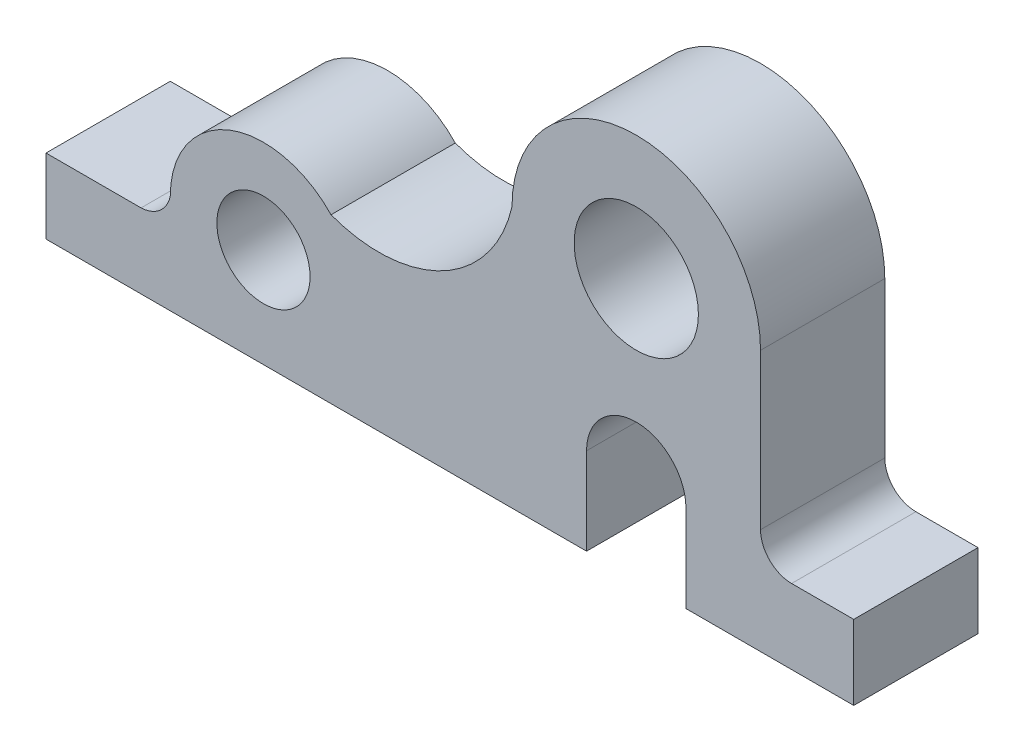
ISO-10303-21;
HEADER;
FILE_DESCRIPTION(('STEP AP214'),'2;1');
FILE_NAME('part.step','',(''),(''),'','','');
FILE_SCHEMA(('AUTOMOTIVE_DESIGN { 1 0 10303 214 1 1 1 1 }'));
ENDSEC;
DATA;
#1=APPLICATION_CONTEXT('core data for automotive mechanical design processes');
#2=APPLICATION_PROTOCOL_DEFINITION('international standard','automotive_design',2000,#1);
#3=PRODUCT_CONTEXT('',#1,'mechanical');
#4=PRODUCT('Part','Part','',(#3));
#5=PRODUCT_RELATED_PRODUCT_CATEGORY('part','',(#4));
#6=PRODUCT_DEFINITION_FORMATION('','',#4);
#7=PRODUCT_DEFINITION_CONTEXT('part definition',#1,'design');
#8=PRODUCT_DEFINITION('design','',#6,#7);
#9=PRODUCT_DEFINITION_SHAPE('','',#8);
#10=(LENGTH_UNIT() NAMED_UNIT(*) SI_UNIT(.MILLI.,.METRE.));
#11=(NAMED_UNIT(*) PLANE_ANGLE_UNIT() SI_UNIT($,.RADIAN.));
#12=(NAMED_UNIT(*) SI_UNIT($,.STERADIAN.) SOLID_ANGLE_UNIT());
#13=UNCERTAINTY_MEASURE_WITH_UNIT(LENGTH_MEASURE(1.E-05),#10,'distance_accuracy_value','');
#14=(GEOMETRIC_REPRESENTATION_CONTEXT(3) GLOBAL_UNCERTAINTY_ASSIGNED_CONTEXT((#13)) GLOBAL_UNIT_ASSIGNED_CONTEXT((#10,
#11,#12)) REPRESENTATION_CONTEXT('',''));
#15=CARTESIAN_POINT('',(0.,0.,0.));
#16=DIRECTION('',(0.,0.,1.));
#17=DIRECTION('',(1.,0.,0.));
#18=AXIS2_PLACEMENT_3D('',#15,#16,#17);
#19=CARTESIAN_POINT('',(15.1002070773212,16.9960066841476,10.));
#20=DIRECTION('',(0.,0.,1.));
#21=DIRECTION('',(1.,0.,0.));
#22=AXIS2_PLACEMENT_3D('',#19,#20,#21);
#23=PLANE('',#22);
#24=CARTESIAN_POINT('',(35.,16.,10.));
#25=DIRECTION('',(0.,0.,1.));
#26=DIRECTION('',(1.,0.,0.));
#27=AXIS2_PLACEMENT_3D('',#24,#25,#26);
#28=CIRCLE('',#27,7.5);
#29=CARTESIAN_POINT('',(42.5,16.,10.));
#30=VERTEX_POINT('',#29);
#31=EDGE_CURVE('E178',#30,#30,#28,.T.);
#32=ORIENTED_EDGE('',*,*,#31,.F.);
#33=EDGE_LOOP('',(#32));
#34=FACE_BOUND('',#33,.T.);
#35=DIRECTION('',(0.,-1.,0.));
#36=VECTOR('',#35,1.);
#37=CARTESIAN_POINT('',(0.,0.,10.));
#38=LINE('',#37,#36);
#39=CARTESIAN_POINT('',(0.,12.,10.));
#40=VERTEX_POINT('',#39);
#41=CARTESIAN_POINT('',(0.,0.,10.));
#42=VERTEX_POINT('',#41);
#43=EDGE_CURVE('E203',#40,#42,#38,.T.);
#44=ORIENTED_EDGE('',*,*,#43,.T.);
#45=DIRECTION('',(1.,0.,0.));
#46=VECTOR('',#45,1.);
#47=CARTESIAN_POINT('',(0.,0.,10.));
#48=LINE('',#47,#46);
#49=CARTESIAN_POINT('',(87.,0.,10.));
#50=VERTEX_POINT('',#49);
#51=EDGE_CURVE('E116',#42,#50,#48,.T.);
#52=ORIENTED_EDGE('',*,*,#51,.T.);
#53=DIRECTION('',(0.,1.,0.));
#54=VECTOR('',#53,1.);
#55=CARTESIAN_POINT('',(87.,0.,10.));
#56=LINE('',#55,#54);
#57=CARTESIAN_POINT('',(87.,14.,10.));
#58=VERTEX_POINT('',#57);
#59=EDGE_CURVE('E239',#50,#58,#56,.T.);
#60=ORIENTED_EDGE('',*,*,#59,.T.);
#61=CARTESIAN_POINT('',(95.,14.,10.));
#62=DIRECTION('',(0.,0.,-1.));
#63=DIRECTION('',(-1.,0.,0.));
#64=AXIS2_PLACEMENT_3D('',#61,#62,#63);
#65=CIRCLE('',#64,8.);
#66=CARTESIAN_POINT('',(103.,14.,10.));
#67=VERTEX_POINT('',#66);
#68=EDGE_CURVE('E258',#58,#67,#65,.T.);
#69=ORIENTED_EDGE('',*,*,#68,.T.);
#70=DIRECTION('',(0.,-1.,0.));
#71=VECTOR('',#70,1.);
#72=CARTESIAN_POINT('',(103.,14.,10.));
#73=LINE('',#72,#71);
#74=CARTESIAN_POINT('',(103.,0.,10.));
#75=VERTEX_POINT('',#74);
#76=EDGE_CURVE('E255',#67,#75,#73,.T.);
#77=ORIENTED_EDGE('',*,*,#76,.T.);
#78=DIRECTION('',(1.,0.,0.));
#79=VECTOR('',#78,1.);
#80=CARTESIAN_POINT('',(103.,0.,10.));
#81=LINE('',#80,#79);
#82=CARTESIAN_POINT('',(130.,0.,10.));
#83=VERTEX_POINT('',#82);
#84=EDGE_CURVE('E257',#75,#83,#81,.T.);
#85=ORIENTED_EDGE('',*,*,#84,.T.);
#86=DIRECTION('',(0.,1.,0.));
#87=VECTOR('',#86,1.);
#88=CARTESIAN_POINT('',(130.,0.,10.));
#89=LINE('',#88,#87);
#90=CARTESIAN_POINT('',(130.,12.,10.));
#91=VERTEX_POINT('',#90);
#92=EDGE_CURVE('E260',#83,#91,#89,.T.);
#93=ORIENTED_EDGE('',*,*,#92,.T.);
#94=DIRECTION('',(-1.,0.,0.));
#95=VECTOR('',#94,1.);
#96=CARTESIAN_POINT('',(120.,12.,10.));
#97=LINE('',#96,#95);
#98=CARTESIAN_POINT('',(120.,12.,10.));
#99=VERTEX_POINT('',#98);
#100=EDGE_CURVE('E266',#91,#99,#97,.T.);
#101=ORIENTED_EDGE('',*,*,#100,.T.);
#102=CARTESIAN_POINT('',(120.,17.,10.));
#103=DIRECTION('',(0.,0.,-1.));
#104=DIRECTION('',(1.,0.,0.));
#105=AXIS2_PLACEMENT_3D('',#102,#103,#104);
#106=CIRCLE('',#105,5.);
#107=CARTESIAN_POINT('',(115.,17.,10.));
#108=VERTEX_POINT('',#107);
#109=EDGE_CURVE('E268',#99,#108,#106,.T.);
#110=ORIENTED_EDGE('',*,*,#109,.T.);
#111=DIRECTION('',(0.,1.,0.));
#112=VECTOR('',#111,1.);
#113=CARTESIAN_POINT('',(115.,42.,10.));
#114=LINE('',#113,#112);
#115=CARTESIAN_POINT('',(115.,42.,10.));
#116=VERTEX_POINT('',#115);
#117=EDGE_CURVE('E270',#108,#116,#114,.T.);
#118=ORIENTED_EDGE('',*,*,#117,.T.);
#119=CARTESIAN_POINT('',(95.,42.,10.));
#120=DIRECTION('',(0.,0.,1.));
#121=DIRECTION('',(1.,0.,0.));
#122=AXIS2_PLACEMENT_3D('',#119,#120,#121);
#123=CIRCLE('',#122,20.);
#124=CARTESIAN_POINT('',(75.,42.,10.));
#125=VERTEX_POINT('',#124);
#126=EDGE_CURVE('E272',#116,#125,#123,.T.);
#127=ORIENTED_EDGE('',*,*,#126,.T.);
#128=CARTESIAN_POINT('',(53.5628393291746,46.9445062820485,10.));
#129=DIRECTION('',(0.,0.,-1.));
#130=DIRECTION('',(1.,0.,0.));
#131=AXIS2_PLACEMENT_3D('',#128,#129,#130);
#132=CIRCLE('',#131,22.);
#133=CARTESIAN_POINT('',(45.8746463214635,26.331605266515,10.));
#134=VERTEX_POINT('',#133);
#135=EDGE_CURVE('E156',#125,#134,#132,.T.);
#136=ORIENTED_EDGE('',*,*,#135,.T.);
#137=CARTESIAN_POINT('',(35.,16.,10.));
#138=DIRECTION('',(0.,0.,1.));
#139=DIRECTION('',(1.,0.,0.));
#140=AXIS2_PLACEMENT_3D('',#137,#138,#139);
#141=CIRCLE('',#140,15.);
#142=CARTESIAN_POINT('',(20.,16.,10.));
#143=VERTEX_POINT('',#142);
#144=EDGE_CURVE('E150',#134,#143,#141,.T.);
#145=ORIENTED_EDGE('',*,*,#144,.T.);
#146=CARTESIAN_POINT('',(15.1002070773212,16.9960066841476,10.));
#147=DIRECTION('',(0.,0.,-1.));
#148=DIRECTION('',(1.,0.,0.));
#149=AXIS2_PLACEMENT_3D('',#146,#147,#148);
#150=CIRCLE('',#149,5.);
#151=CARTESIAN_POINT('',(15.3,12.,10.));
#152=VERTEX_POINT('',#151);
#153=EDGE_CURVE('E154',#143,#152,#150,.T.);
#154=ORIENTED_EDGE('',*,*,#153,.T.);
#155=DIRECTION('',(-1.,0.,0.));
#156=VECTOR('',#155,1.);
#157=CARTESIAN_POINT('',(0.,12.,10.));
#158=LINE('',#157,#156);
#159=EDGE_CURVE('E52',#152,#40,#158,.T.);
#160=ORIENTED_EDGE('',*,*,#159,.T.);
#161=EDGE_LOOP('',(#44,#52,#60,#69,#77,#85,#93,#101,#110,#118,#127,#136,#145,#154,#160));
#162=FACE_BOUND('',#161,.T.);
#163=CARTESIAN_POINT('',(95.,42.,10.));
#164=DIRECTION('',(0.,0.,1.));
#165=DIRECTION('',(1.,0.,0.));
#166=AXIS2_PLACEMENT_3D('',#163,#164,#165);
#167=CIRCLE('',#166,9.99999999999999);
#168=CARTESIAN_POINT('',(105.,42.,10.));
#169=VERTEX_POINT('',#168);
#170=EDGE_CURVE('E314',#169,#169,#167,.T.);
#171=ORIENTED_EDGE('',*,*,#170,.F.);
#172=EDGE_LOOP('',(#171));
#173=FACE_BOUND('',#172,.T.);
#174=ADVANCED_FACE('F35',(#34,#162,#173),#23,.T.);
#175=CARTESIAN_POINT('',(15.1002070773212,16.9960066841476,-10.));
#176=DIRECTION('',(0.,0.,1.));
#177=DIRECTION('',(1.,0.,0.));
#178=AXIS2_PLACEMENT_3D('',#175,#176,#177);
#179=PLANE('',#178);
#180=DIRECTION('',(0.,-1.,0.));
#181=VECTOR('',#180,1.);
#182=CARTESIAN_POINT('',(0.,0.,-10.));
#183=LINE('',#182,#181);
#184=CARTESIAN_POINT('',(0.,12.,-10.));
#185=VERTEX_POINT('',#184);
#186=CARTESIAN_POINT('',(0.,0.,-10.));
#187=VERTEX_POINT('',#186);
#188=EDGE_CURVE('E174',#185,#187,#183,.T.);
#189=ORIENTED_EDGE('',*,*,#188,.F.);
#190=DIRECTION('',(-1.,0.,0.));
#191=VECTOR('',#190,1.);
#192=CARTESIAN_POINT('',(0.,12.,-10.));
#193=LINE('',#192,#191);
#194=CARTESIAN_POINT('',(15.3,12.,-10.));
#195=VERTEX_POINT('',#194);
#196=EDGE_CURVE('E108',#195,#185,#193,.T.);
#197=ORIENTED_EDGE('',*,*,#196,.F.);
#198=CARTESIAN_POINT('',(15.1002070773212,16.9960066841476,-10.));
#199=DIRECTION('',(0.,0.,-1.));
#200=DIRECTION('',(1.,0.,0.));
#201=AXIS2_PLACEMENT_3D('',#198,#199,#200);
#202=CIRCLE('',#201,5.);
#203=CARTESIAN_POINT('',(20.,16.,-10.));
#204=VERTEX_POINT('',#203);
#205=EDGE_CURVE('E102',#204,#195,#202,.T.);
#206=ORIENTED_EDGE('',*,*,#205,.F.);
#207=CARTESIAN_POINT('',(35.,16.,-10.));
#208=DIRECTION('',(0.,0.,1.));
#209=DIRECTION('',(1.,0.,0.));
#210=AXIS2_PLACEMENT_3D('',#207,#208,#209);
#211=CIRCLE('',#210,15.);
#212=CARTESIAN_POINT('',(45.8746463214635,26.331605266515,-10.));
#213=VERTEX_POINT('',#212);
#214=EDGE_CURVE('E164',#213,#204,#211,.T.);
#215=ORIENTED_EDGE('',*,*,#214,.F.);
#216=CARTESIAN_POINT('',(53.5628393291746,46.9445062820485,-10.));
#217=DIRECTION('',(0.,0.,-1.));
#218=DIRECTION('',(1.,0.,0.));
#219=AXIS2_PLACEMENT_3D('',#216,#217,#218);
#220=CIRCLE('',#219,22.);
#221=CARTESIAN_POINT('',(75.,42.,-10.));
#222=VERTEX_POINT('',#221);
#223=EDGE_CURVE('E198',#222,#213,#220,.T.);
#224=ORIENTED_EDGE('',*,*,#223,.F.);
#225=CARTESIAN_POINT('',(95.,42.,-10.));
#226=DIRECTION('',(0.,0.,1.));
#227=DIRECTION('',(1.,0.,0.));
#228=AXIS2_PLACEMENT_3D('',#225,#226,#227);
#229=CIRCLE('',#228,20.);
#230=CARTESIAN_POINT('',(115.,42.,-10.));
#231=VERTEX_POINT('',#230);
#232=EDGE_CURVE('E196',#231,#222,#229,.T.);
#233=ORIENTED_EDGE('',*,*,#232,.F.);
#234=DIRECTION('',(0.,1.,0.));
#235=VECTOR('',#234,1.);
#236=CARTESIAN_POINT('',(115.,42.,-10.));
#237=LINE('',#236,#235);
#238=CARTESIAN_POINT('',(115.,17.,-10.));
#239=VERTEX_POINT('',#238);
#240=EDGE_CURVE('E194',#239,#231,#237,.T.);
#241=ORIENTED_EDGE('',*,*,#240,.F.);
#242=CARTESIAN_POINT('',(120.,17.,-10.));
#243=DIRECTION('',(0.,0.,-1.));
#244=DIRECTION('',(1.,0.,0.));
#245=AXIS2_PLACEMENT_3D('',#242,#243,#244);
#246=CIRCLE('',#245,5.);
#247=CARTESIAN_POINT('',(120.,12.,-10.));
#248=VERTEX_POINT('',#247);
#249=EDGE_CURVE('E192',#248,#239,#246,.T.);
#250=ORIENTED_EDGE('',*,*,#249,.F.);
#251=DIRECTION('',(-1.,0.,0.));
#252=VECTOR('',#251,1.);
#253=CARTESIAN_POINT('',(120.,12.,-10.));
#254=LINE('',#253,#252);
#255=CARTESIAN_POINT('',(130.,12.,-10.));
#256=VERTEX_POINT('',#255);
#257=EDGE_CURVE('E190',#256,#248,#254,.T.);
#258=ORIENTED_EDGE('',*,*,#257,.F.);
#259=DIRECTION('',(0.,1.,0.));
#260=VECTOR('',#259,1.);
#261=CARTESIAN_POINT('',(130.,0.,-10.));
#262=LINE('',#261,#260);
#263=CARTESIAN_POINT('',(130.,0.,-10.));
#264=VERTEX_POINT('',#263);
#265=EDGE_CURVE('E188',#264,#256,#262,.T.);
#266=ORIENTED_EDGE('',*,*,#265,.F.);
#267=DIRECTION('',(1.,0.,0.));
#268=VECTOR('',#267,1.);
#269=CARTESIAN_POINT('',(103.,0.,-10.));
#270=LINE('',#269,#268);
#271=CARTESIAN_POINT('',(103.,0.,-10.));
#272=VERTEX_POINT('',#271);
#273=EDGE_CURVE('E186',#272,#264,#270,.T.);
#274=ORIENTED_EDGE('',*,*,#273,.F.);
#275=DIRECTION('',(0.,-1.,0.));
#276=VECTOR('',#275,1.);
#277=CARTESIAN_POINT('',(103.,14.,-10.));
#278=LINE('',#277,#276);
#279=CARTESIAN_POINT('',(103.,14.,-10.));
#280=VERTEX_POINT('',#279);
#281=EDGE_CURVE('E184',#280,#272,#278,.T.);
#282=ORIENTED_EDGE('',*,*,#281,.F.);
#283=CARTESIAN_POINT('',(95.,14.,-10.));
#284=DIRECTION('',(0.,0.,-1.));
#285=DIRECTION('',(-1.,0.,0.));
#286=AXIS2_PLACEMENT_3D('',#283,#284,#285);
#287=CIRCLE('',#286,8.);
#288=CARTESIAN_POINT('',(87.,14.,-10.));
#289=VERTEX_POINT('',#288);
#290=EDGE_CURVE('E182',#289,#280,#287,.T.);
#291=ORIENTED_EDGE('',*,*,#290,.F.);
#292=DIRECTION('',(0.,1.,0.));
#293=VECTOR('',#292,1.);
#294=CARTESIAN_POINT('',(87.,0.,-10.));
#295=LINE('',#294,#293);
#296=CARTESIAN_POINT('',(87.,0.,-10.));
#297=VERTEX_POINT('',#296);
#298=EDGE_CURVE('E180',#297,#289,#295,.T.);
#299=ORIENTED_EDGE('',*,*,#298,.F.);
#300=DIRECTION('',(1.,0.,0.));
#301=VECTOR('',#300,1.);
#302=CARTESIAN_POINT('',(0.,0.,-10.));
#303=LINE('',#302,#301);
#304=EDGE_CURVE('E177',#187,#297,#303,.T.);
#305=ORIENTED_EDGE('',*,*,#304,.F.);
#306=EDGE_LOOP('',(#189,#197,#206,#215,#224,#233,#241,#250,#258,#266,#274,#282,#291,#299,#305));
#307=FACE_BOUND('',#306,.T.);
#308=CARTESIAN_POINT('',(35.,16.,-10.));
#309=DIRECTION('',(0.,0.,1.));
#310=DIRECTION('',(1.,0.,0.));
#311=AXIS2_PLACEMENT_3D('',#308,#309,#310);
#312=CIRCLE('',#311,7.5);
#313=CARTESIAN_POINT('',(42.5,16.,-10.));
#314=VERTEX_POINT('',#313);
#315=EDGE_CURVE('E320',#314,#314,#312,.T.);
#316=ORIENTED_EDGE('',*,*,#315,.T.);
#317=EDGE_LOOP('',(#316));
#318=FACE_BOUND('',#317,.T.);
#319=CARTESIAN_POINT('',(95.,42.,-10.));
#320=DIRECTION('',(0.,0.,1.));
#321=DIRECTION('',(1.,0.,0.));
#322=AXIS2_PLACEMENT_3D('',#319,#320,#321);
#323=CIRCLE('',#322,9.99999999999999);
#324=CARTESIAN_POINT('',(105.,42.,-10.));
#325=VERTEX_POINT('',#324);
#326=EDGE_CURVE('E317',#325,#325,#323,.T.);
#327=ORIENTED_EDGE('',*,*,#326,.T.);
#328=EDGE_LOOP('',(#327));
#329=FACE_BOUND('',#328,.T.);
#330=ADVANCED_FACE('F243',(#307,#318,#329),#179,.F.);
#331=CARTESIAN_POINT('',(0.,0.,10.));
#332=DIRECTION('',(1.,0.,0.));
#333=DIRECTION('',(0.,0.,-1.));
#334=AXIS2_PLACEMENT_3D('',#331,#332,#333);
#335=PLANE('',#334);
#336=ORIENTED_EDGE('',*,*,#188,.T.);
#337=DIRECTION('',(0.,0.,-1.));
#338=VECTOR('',#337,1.);
#339=CARTESIAN_POINT('',(0.,0.,10.));
#340=LINE('',#339,#338);
#341=EDGE_CURVE('E11',#42,#187,#340,.T.);
#342=ORIENTED_EDGE('',*,*,#341,.F.);
#343=ORIENTED_EDGE('',*,*,#43,.F.);
#344=DIRECTION('',(0.,0.,-1.));
#345=VECTOR('',#344,1.);
#346=CARTESIAN_POINT('',(0.,12.,10.));
#347=LINE('',#346,#345);
#348=EDGE_CURVE('E170',#40,#185,#347,.T.);
#349=ORIENTED_EDGE('',*,*,#348,.T.);
#350=EDGE_LOOP('',(#336,#342,#343,#349));
#351=FACE_BOUND('',#350,.T.);
#352=ADVANCED_FACE('F37',(#351),#335,.F.);
#353=CARTESIAN_POINT('',(0.,0.,10.));
#354=DIRECTION('',(0.,1.,0.));
#355=DIRECTION('',(0.,0.,1.));
#356=AXIS2_PLACEMENT_3D('',#353,#354,#355);
#357=PLANE('',#356);
#358=ORIENTED_EDGE('',*,*,#304,.T.);
#359=DIRECTION('',(0.,0.,-1.));
#360=VECTOR('',#359,1.);
#361=CARTESIAN_POINT('',(87.,0.,10.));
#362=LINE('',#361,#360);
#363=EDGE_CURVE('E44',#50,#297,#362,.T.);
#364=ORIENTED_EDGE('',*,*,#363,.F.);
#365=ORIENTED_EDGE('',*,*,#51,.F.);
#366=ORIENTED_EDGE('',*,*,#341,.T.);
#367=EDGE_LOOP('',(#358,#364,#365,#366));
#368=FACE_BOUND('',#367,.T.);
#369=ADVANCED_FACE('F443',(#368),#357,.F.);
#370=CARTESIAN_POINT('',(87.,0.,10.));
#371=DIRECTION('',(-1.,0.,0.));
#372=DIRECTION('',(0.,0.,1.));
#373=AXIS2_PLACEMENT_3D('',#370,#371,#372);
#374=PLANE('',#373);
#375=ORIENTED_EDGE('',*,*,#298,.T.);
#376=DIRECTION('',(0.,0.,-1.));
#377=VECTOR('',#376,1.);
#378=CARTESIAN_POINT('',(87.,14.,10.));
#379=LINE('',#378,#377);
#380=EDGE_CURVE('E231',#58,#289,#379,.T.);
#381=ORIENTED_EDGE('',*,*,#380,.F.);
#382=ORIENTED_EDGE('',*,*,#59,.F.);
#383=ORIENTED_EDGE('',*,*,#363,.T.);
#384=EDGE_LOOP('',(#375,#381,#382,#383));
#385=FACE_BOUND('',#384,.T.);
#386=ADVANCED_FACE('F237',(#385),#374,.F.);
#387=CARTESIAN_POINT('',(95.,14.,10.));
#388=DIRECTION('',(0.,0.,-1.));
#389=DIRECTION('',(-1.,0.,0.));
#390=AXIS2_PLACEMENT_3D('',#387,#388,#389);
#391=CYLINDRICAL_SURFACE('',#390,8.);
#392=ORIENTED_EDGE('',*,*,#290,.T.);
#393=DIRECTION('',(0.,0.,-1.));
#394=VECTOR('',#393,1.);
#395=CARTESIAN_POINT('',(103.,14.,10.));
#396=LINE('',#395,#394);
#397=EDGE_CURVE('E228',#67,#280,#396,.T.);
#398=ORIENTED_EDGE('',*,*,#397,.F.);
#399=ORIENTED_EDGE('',*,*,#68,.F.);
#400=ORIENTED_EDGE('',*,*,#380,.T.);
#401=EDGE_LOOP('',(#392,#398,#399,#400));
#402=FACE_BOUND('',#401,.T.);
#403=ADVANCED_FACE('F249',(#402),#391,.F.);
#404=CARTESIAN_POINT('',(103.,14.,10.));
#405=DIRECTION('',(1.,0.,0.));
#406=DIRECTION('',(0.,0.,-1.));
#407=AXIS2_PLACEMENT_3D('',#404,#405,#406);
#408=PLANE('',#407);
#409=ORIENTED_EDGE('',*,*,#281,.T.);
#410=DIRECTION('',(0.,0.,-1.));
#411=VECTOR('',#410,1.);
#412=CARTESIAN_POINT('',(103.,0.,10.));
#413=LINE('',#412,#411);
#414=EDGE_CURVE('E225',#75,#272,#413,.T.);
#415=ORIENTED_EDGE('',*,*,#414,.F.);
#416=ORIENTED_EDGE('',*,*,#76,.F.);
#417=ORIENTED_EDGE('',*,*,#397,.T.);
#418=EDGE_LOOP('',(#409,#415,#416,#417));
#419=FACE_BOUND('',#418,.T.);
#420=ADVANCED_FACE('F253',(#419),#408,.F.);
#421=CARTESIAN_POINT('',(103.,0.,10.));
#422=DIRECTION('',(0.,1.,0.));
#423=DIRECTION('',(0.,0.,1.));
#424=AXIS2_PLACEMENT_3D('',#421,#422,#423);
#425=PLANE('',#424);
#426=ORIENTED_EDGE('',*,*,#273,.T.);
#427=DIRECTION('',(0.,0.,-1.));
#428=VECTOR('',#427,1.);
#429=CARTESIAN_POINT('',(130.,0.,10.));
#430=LINE('',#429,#428);
#431=EDGE_CURVE('E222',#83,#264,#430,.T.);
#432=ORIENTED_EDGE('',*,*,#431,.F.);
#433=ORIENTED_EDGE('',*,*,#84,.F.);
#434=ORIENTED_EDGE('',*,*,#414,.T.);
#435=EDGE_LOOP('',(#426,#432,#433,#434));
#436=FACE_BOUND('',#435,.T.);
#437=ADVANCED_FACE('F408',(#436),#425,.F.);
#438=CARTESIAN_POINT('',(130.,0.,10.));
#439=DIRECTION('',(-1.,0.,0.));
#440=DIRECTION('',(0.,0.,1.));
#441=AXIS2_PLACEMENT_3D('',#438,#439,#440);
#442=PLANE('',#441);
#443=ORIENTED_EDGE('',*,*,#265,.T.);
#444=DIRECTION('',(0.,0.,-1.));
#445=VECTOR('',#444,1.);
#446=CARTESIAN_POINT('',(130.,12.,10.));
#447=LINE('',#446,#445);
#448=EDGE_CURVE('E219',#91,#256,#447,.T.);
#449=ORIENTED_EDGE('',*,*,#448,.F.);
#450=ORIENTED_EDGE('',*,*,#92,.F.);
#451=ORIENTED_EDGE('',*,*,#431,.T.);
#452=EDGE_LOOP('',(#443,#449,#450,#451));
#453=FACE_BOUND('',#452,.T.);
#454=ADVANCED_FACE('F398',(#453),#442,.F.);
#455=CARTESIAN_POINT('',(120.,12.,10.));
#456=DIRECTION('',(0.,-1.,0.));
#457=DIRECTION('',(0.,0.,-1.));
#458=AXIS2_PLACEMENT_3D('',#455,#456,#457);
#459=PLANE('',#458);
#460=ORIENTED_EDGE('',*,*,#257,.T.);
#461=DIRECTION('',(0.,0.,-1.));
#462=VECTOR('',#461,1.);
#463=CARTESIAN_POINT('',(120.,12.,10.));
#464=LINE('',#463,#462);
#465=EDGE_CURVE('E216',#99,#248,#464,.T.);
#466=ORIENTED_EDGE('',*,*,#465,.F.);
#467=ORIENTED_EDGE('',*,*,#100,.F.);
#468=ORIENTED_EDGE('',*,*,#448,.T.);
#469=EDGE_LOOP('',(#460,#466,#467,#468));
#470=FACE_BOUND('',#469,.T.);
#471=ADVANCED_FACE('F388',(#470),#459,.F.);
#472=CARTESIAN_POINT('',(120.,17.,10.));
#473=DIRECTION('',(0.,0.,-1.));
#474=DIRECTION('',(-1.,0.,0.));
#475=AXIS2_PLACEMENT_3D('',#472,#473,#474);
#476=CYLINDRICAL_SURFACE('',#475,5.);
#477=ORIENTED_EDGE('',*,*,#249,.T.);
#478=DIRECTION('',(0.,0.,-1.));
#479=VECTOR('',#478,1.);
#480=CARTESIAN_POINT('',(115.,17.,10.));
#481=LINE('',#480,#479);
#482=EDGE_CURVE('E213',#108,#239,#481,.T.);
#483=ORIENTED_EDGE('',*,*,#482,.F.);
#484=ORIENTED_EDGE('',*,*,#109,.F.);
#485=ORIENTED_EDGE('',*,*,#465,.T.);
#486=EDGE_LOOP('',(#477,#483,#484,#485));
#487=FACE_BOUND('',#486,.T.);
#488=ADVANCED_FACE('F378',(#487),#476,.F.);
#489=CARTESIAN_POINT('',(115.,42.,10.));
#490=DIRECTION('',(-1.,0.,0.));
#491=DIRECTION('',(0.,0.,1.));
#492=AXIS2_PLACEMENT_3D('',#489,#490,#491);
#493=PLANE('',#492);
#494=ORIENTED_EDGE('',*,*,#240,.T.);
#495=DIRECTION('',(0.,0.,-1.));
#496=VECTOR('',#495,1.);
#497=CARTESIAN_POINT('',(115.,42.,10.));
#498=LINE('',#497,#496);
#499=EDGE_CURVE('E210',#116,#231,#498,.T.);
#500=ORIENTED_EDGE('',*,*,#499,.F.);
#501=ORIENTED_EDGE('',*,*,#117,.F.);
#502=ORIENTED_EDGE('',*,*,#482,.T.);
#503=EDGE_LOOP('',(#494,#500,#501,#502));
#504=FACE_BOUND('',#503,.T.);
#505=ADVANCED_FACE('F369',(#504),#493,.F.);
#506=CARTESIAN_POINT('',(95.,42.,10.));
#507=DIRECTION('',(0.,0.,-1.));
#508=DIRECTION('',(-1.,0.,0.));
#509=AXIS2_PLACEMENT_3D('',#506,#507,#508);
#510=CYLINDRICAL_SURFACE('',#509,20.);
#511=ORIENTED_EDGE('',*,*,#232,.T.);
#512=DIRECTION('',(0.,0.,-1.));
#513=VECTOR('',#512,1.);
#514=CARTESIAN_POINT('',(75.,42.,10.));
#515=LINE('',#514,#513);
#516=EDGE_CURVE('E207',#125,#222,#515,.T.);
#517=ORIENTED_EDGE('',*,*,#516,.F.);
#518=ORIENTED_EDGE('',*,*,#126,.F.);
#519=ORIENTED_EDGE('',*,*,#499,.T.);
#520=EDGE_LOOP('',(#511,#517,#518,#519));
#521=FACE_BOUND('',#520,.T.);
#522=ADVANCED_FACE('F278',(#521),#510,.T.);
#523=CARTESIAN_POINT('',(53.5628393291746,46.9445062820485,10.));
#524=DIRECTION('',(0.,0.,-1.));
#525=DIRECTION('',(-1.,0.,0.));
#526=AXIS2_PLACEMENT_3D('',#523,#524,#525);
#527=CYLINDRICAL_SURFACE('',#526,22.);
#528=ORIENTED_EDGE('',*,*,#223,.T.);
#529=DIRECTION('',(0.,0.,-1.));
#530=VECTOR('',#529,1.);
#531=CARTESIAN_POINT('',(45.8746463214635,26.331605266515,10.));
#532=LINE('',#531,#530);
#533=EDGE_CURVE('E165',#134,#213,#532,.T.);
#534=ORIENTED_EDGE('',*,*,#533,.F.);
#535=ORIENTED_EDGE('',*,*,#135,.F.);
#536=ORIENTED_EDGE('',*,*,#516,.T.);
#537=EDGE_LOOP('',(#528,#534,#535,#536));
#538=FACE_BOUND('',#537,.T.);
#539=ADVANCED_FACE('F282',(#538),#527,.F.);
#540=CARTESIAN_POINT('',(35.,16.,10.));
#541=DIRECTION('',(0.,0.,-1.));
#542=DIRECTION('',(-1.,0.,0.));
#543=AXIS2_PLACEMENT_3D('',#540,#541,#542);
#544=CYLINDRICAL_SURFACE('',#543,15.);
#545=ORIENTED_EDGE('',*,*,#214,.T.);
#546=DIRECTION('',(0.,0.,-1.));
#547=VECTOR('',#546,1.);
#548=CARTESIAN_POINT('',(20.,16.,10.));
#549=LINE('',#548,#547);
#550=EDGE_CURVE('E161',#143,#204,#549,.T.);
#551=ORIENTED_EDGE('',*,*,#550,.F.);
#552=ORIENTED_EDGE('',*,*,#144,.F.);
#553=ORIENTED_EDGE('',*,*,#533,.T.);
#554=EDGE_LOOP('',(#545,#551,#552,#553));
#555=FACE_BOUND('',#554,.T.);
#556=ADVANCED_FACE('F162',(#555),#544,.T.);
#557=CARTESIAN_POINT('',(15.1002070773212,16.9960066841476,10.));
#558=DIRECTION('',(0.,0.,-1.));
#559=DIRECTION('',(-1.,0.,0.));
#560=AXIS2_PLACEMENT_3D('',#557,#558,#559);
#561=CYLINDRICAL_SURFACE('',#560,5.);
#562=ORIENTED_EDGE('',*,*,#205,.T.);
#563=DIRECTION('',(0.,0.,-1.));
#564=VECTOR('',#563,1.);
#565=CARTESIAN_POINT('',(15.3,12.,10.));
#566=LINE('',#565,#564);
#567=EDGE_CURVE('E166',#152,#195,#566,.T.);
#568=ORIENTED_EDGE('',*,*,#567,.F.);
#569=ORIENTED_EDGE('',*,*,#153,.F.);
#570=ORIENTED_EDGE('',*,*,#550,.T.);
#571=EDGE_LOOP('',(#562,#568,#569,#570));
#572=FACE_BOUND('',#571,.T.);
#573=ADVANCED_FACE('F168',(#572),#561,.F.);
#574=CARTESIAN_POINT('',(0.,12.,10.));
#575=DIRECTION('',(0.,-1.,0.));
#576=DIRECTION('',(0.,0.,-1.));
#577=AXIS2_PLACEMENT_3D('',#574,#575,#576);
#578=PLANE('',#577);
#579=ORIENTED_EDGE('',*,*,#196,.T.);
#580=ORIENTED_EDGE('',*,*,#348,.F.);
#581=ORIENTED_EDGE('',*,*,#159,.F.);
#582=ORIENTED_EDGE('',*,*,#567,.T.);
#583=EDGE_LOOP('',(#579,#580,#581,#582));
#584=FACE_BOUND('',#583,.T.);
#585=ADVANCED_FACE('F286',(#584),#578,.F.);
#586=CARTESIAN_POINT('',(35.,16.,10.));
#587=DIRECTION('',(0.,0.,-1.));
#588=DIRECTION('',(-1.,0.,0.));
#589=AXIS2_PLACEMENT_3D('',#586,#587,#588);
#590=CYLINDRICAL_SURFACE('',#589,7.5);
#591=ORIENTED_EDGE('',*,*,#31,.T.);
#592=EDGE_LOOP('',(#591));
#593=FACE_BOUND('',#592,.T.);
#594=ORIENTED_EDGE('',*,*,#315,.F.);
#595=EDGE_LOOP('',(#594));
#596=FACE_BOUND('',#595,.T.);
#597=ADVANCED_FACE('F288',(#593,#596),#590,.F.);
#598=CARTESIAN_POINT('',(95.,42.,10.));
#599=DIRECTION('',(0.,0.,-1.));
#600=DIRECTION('',(-1.,0.,0.));
#601=AXIS2_PLACEMENT_3D('',#598,#599,#600);
#602=CYLINDRICAL_SURFACE('',#601,9.99999999999999);
#603=ORIENTED_EDGE('',*,*,#170,.T.);
#604=EDGE_LOOP('',(#603));
#605=FACE_BOUND('',#604,.T.);
#606=ORIENTED_EDGE('',*,*,#326,.F.);
#607=EDGE_LOOP('',(#606));
#608=FACE_BOUND('',#607,.T.);
#609=ADVANCED_FACE('F294',(#605,#608),#602,.F.);
#610=CLOSED_SHELL('',(#174,#330,#352,#369,#386,#403,#420,#437,#454,#471,#488,#505,#522,#539,
#556,#573,#585,#597,#609));
#611=MANIFOLD_SOLID_BREP('B2',#610);
#612=ADVANCED_BREP_SHAPE_REPRESENTATION('',(#18,#611),#14);
#613=SHAPE_DEFINITION_REPRESENTATION(#9,#612);
ENDSEC;
END-ISO-10303-21;
